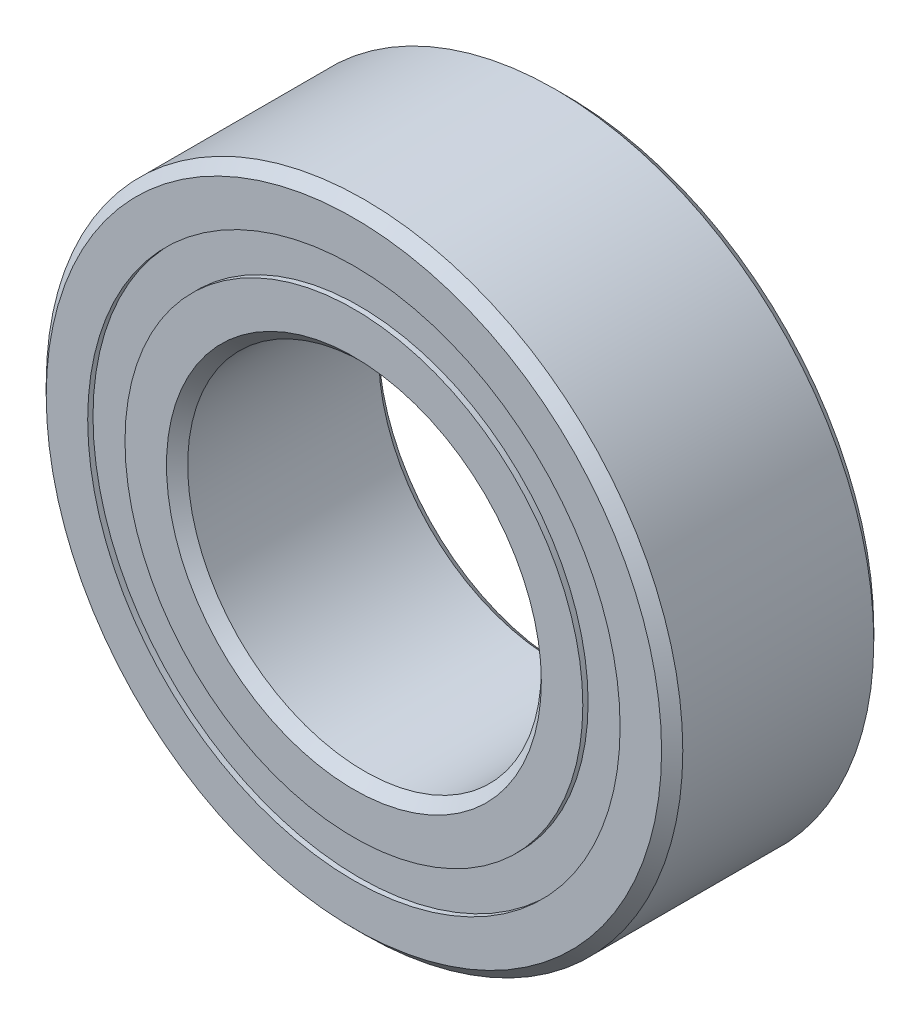
ISO-10303-21;
HEADER;
FILE_DESCRIPTION(('STEP AP214'),'2;1');
FILE_NAME('part.step','',(''),(''),'','','');
FILE_SCHEMA(('AUTOMOTIVE_DESIGN { 1 0 10303 214 1 1 1 1 }'));
ENDSEC;
DATA;
#1=APPLICATION_CONTEXT('core data for automotive mechanical design processes');
#2=APPLICATION_PROTOCOL_DEFINITION('international standard','automotive_design',2000,#1);
#3=PRODUCT_CONTEXT('',#1,'mechanical');
#4=PRODUCT('Part','Part','',(#3));
#5=PRODUCT_RELATED_PRODUCT_CATEGORY('part','',(#4));
#6=PRODUCT_DEFINITION_FORMATION('','',#4);
#7=PRODUCT_DEFINITION_CONTEXT('part definition',#1,'design');
#8=PRODUCT_DEFINITION('design','',#6,#7);
#9=PRODUCT_DEFINITION_SHAPE('','',#8);
#10=(LENGTH_UNIT() NAMED_UNIT(*) SI_UNIT(.MILLI.,.METRE.));
#11=(NAMED_UNIT(*) PLANE_ANGLE_UNIT() SI_UNIT($,.RADIAN.));
#12=(NAMED_UNIT(*) SI_UNIT($,.STERADIAN.) SOLID_ANGLE_UNIT());
#13=UNCERTAINTY_MEASURE_WITH_UNIT(LENGTH_MEASURE(1.E-05),#10,'distance_accuracy_value','');
#14=(GEOMETRIC_REPRESENTATION_CONTEXT(3) GLOBAL_UNCERTAINTY_ASSIGNED_CONTEXT((#13)) GLOBAL_UNIT_ASSIGNED_CONTEXT((#10,
#11,#12)) REPRESENTATION_CONTEXT('',''));
#15=CARTESIAN_POINT('',(0.,0.,0.));
#16=DIRECTION('',(0.,0.,1.));
#17=DIRECTION('',(1.,0.,0.));
#18=AXIS2_PLACEMENT_3D('',#15,#16,#17);
#19=CARTESIAN_POINT('',(0.,3.76373626373626,-1.425));
#20=DIRECTION('',(0.,0.,1.));
#21=DIRECTION('',(1.,0.,0.));
#22=AXIS2_PLACEMENT_3D('',#19,#20,#21);
#23=PLANE('',#22);
#24=CARTESIAN_POINT('',(0.,0.,-1.425));
#25=DIRECTION('',(0.,0.,1.));
#26=DIRECTION('',(1.,0.,0.));
#27=AXIS2_PLACEMENT_3D('',#24,#25,#26);
#28=CIRCLE('',#27,3.76373626373626);
#29=CARTESIAN_POINT('',(3.76373626373626,0.,-1.425));
#30=VERTEX_POINT('',#29);
#31=EDGE_CURVE('E55',#30,#30,#28,.T.);
#32=ORIENTED_EDGE('',*,*,#31,.F.);
#33=EDGE_LOOP('',(#32));
#34=FACE_BOUND('',#33,.T.);
#35=CARTESIAN_POINT('',(0.,0.,-1.425));
#36=DIRECTION('',(0.,0.,1.));
#37=DIRECTION('',(1.,0.,0.));
#38=AXIS2_PLACEMENT_3D('',#35,#36,#37);
#39=CIRCLE('',#38,3.23626373626374);
#40=CARTESIAN_POINT('',(3.23626373626374,0.,-1.425));
#41=VERTEX_POINT('',#40);
#42=EDGE_CURVE('E11',#41,#41,#39,.T.);
#43=ORIENTED_EDGE('',*,*,#42,.T.);
#44=EDGE_LOOP('',(#43));
#45=FACE_BOUND('',#44,.T.);
#46=ADVANCED_FACE('F41',(#34,#45),#23,.F.);
#47=CARTESIAN_POINT('',(0.,0.,1.5));
#48=DIRECTION('',(0.,0.,1.));
#49=DIRECTION('',(1.,0.,0.));
#50=AXIS2_PLACEMENT_3D('',#47,#48,#49);
#51=CYLINDRICAL_SURFACE('',#50,3.23626373626374);
#52=ORIENTED_EDGE('',*,*,#42,.F.);
#53=EDGE_LOOP('',(#52));
#54=FACE_BOUND('',#53,.T.);
#55=CARTESIAN_POINT('',(0.,0.,-0.716938812768572));
#56=DIRECTION('',(0.,0.,1.));
#57=DIRECTION('',(1.,0.,0.));
#58=AXIS2_PLACEMENT_3D('',#55,#56,#57);
#59=CIRCLE('',#58,3.23626373626374);
#60=CARTESIAN_POINT('',(3.23626373626374,0.,-0.716938812768572));
#61=VERTEX_POINT('',#60);
#62=EDGE_CURVE('E47',#61,#61,#59,.T.);
#63=ORIENTED_EDGE('',*,*,#62,.T.);
#64=EDGE_LOOP('',(#63));
#65=FACE_BOUND('',#64,.T.);
#66=ADVANCED_FACE('F64',(#54,#65),#51,.F.);
#67=CARTESIAN_POINT('',(0.,3.76373626373626,-0.716938812768571));
#68=DIRECTION('',(0.,0.,-1.));
#69=DIRECTION('',(-1.,0.,0.));
#70=AXIS2_PLACEMENT_3D('',#67,#68,#69);
#71=PLANE('',#70);
#72=ORIENTED_EDGE('',*,*,#62,.F.);
#73=EDGE_LOOP('',(#72));
#74=FACE_BOUND('',#73,.T.);
#75=CARTESIAN_POINT('',(0.,0.,-0.716938812768571));
#76=DIRECTION('',(0.,0.,1.));
#77=DIRECTION('',(1.,0.,0.));
#78=AXIS2_PLACEMENT_3D('',#75,#76,#77);
#79=CIRCLE('',#78,3.76373626373626);
#80=CARTESIAN_POINT('',(3.76373626373626,0.,-0.716938812768571));
#81=VERTEX_POINT('',#80);
#82=EDGE_CURVE('E51',#81,#81,#79,.T.);
#83=ORIENTED_EDGE('',*,*,#82,.T.);
#84=EDGE_LOOP('',(#83));
#85=FACE_BOUND('',#84,.T.);
#86=ADVANCED_FACE('F68',(#74,#85),#71,.F.);
#87=CARTESIAN_POINT('',(0.,0.,1.5));
#88=DIRECTION('',(0.,0.,1.));
#89=DIRECTION('',(1.,0.,0.));
#90=AXIS2_PLACEMENT_3D('',#87,#88,#89);
#91=CYLINDRICAL_SURFACE('',#90,3.76373626373626);
#92=ORIENTED_EDGE('',*,*,#82,.F.);
#93=EDGE_LOOP('',(#92));
#94=FACE_BOUND('',#93,.T.);
#95=ORIENTED_EDGE('',*,*,#31,.T.);
#96=EDGE_LOOP('',(#95));
#97=FACE_BOUND('',#96,.T.);
#98=ADVANCED_FACE('F61',(#94,#97),#91,.T.);
#99=CLOSED_SHELL('',(#46,#66,#86,#98));
#100=MANIFOLD_SOLID_BREP('B2',#99);
#101=CARTESIAN_POINT('',(0.,3.76373626373626,1.425));
#102=DIRECTION('',(0.,0.,-1.));
#103=DIRECTION('',(-1.,0.,0.));
#104=AXIS2_PLACEMENT_3D('',#101,#102,#103);
#105=PLANE('',#104);
#106=CARTESIAN_POINT('',(0.,0.,1.425));
#107=DIRECTION('',(0.,0.,1.));
#108=DIRECTION('',(1.,0.,0.));
#109=AXIS2_PLACEMENT_3D('',#106,#107,#108);
#110=CIRCLE('',#109,3.23626373626374);
#111=CARTESIAN_POINT('',(3.23626373626374,0.,1.425));
#112=VERTEX_POINT('',#111);
#113=EDGE_CURVE('E40',#112,#112,#110,.T.);
#114=ORIENTED_EDGE('',*,*,#113,.F.);
#115=EDGE_LOOP('',(#114));
#116=FACE_BOUND('',#115,.T.);
#117=CARTESIAN_POINT('',(0.,0.,1.425));
#118=DIRECTION('',(0.,0.,1.));
#119=DIRECTION('',(1.,0.,0.));
#120=AXIS2_PLACEMENT_3D('',#117,#118,#119);
#121=CIRCLE('',#120,3.76373626373626);
#122=CARTESIAN_POINT('',(3.76373626373626,0.,1.425));
#123=VERTEX_POINT('',#122);
#124=EDGE_CURVE('E122',#123,#123,#121,.T.);
#125=ORIENTED_EDGE('',*,*,#124,.T.);
#126=EDGE_LOOP('',(#125));
#127=FACE_BOUND('',#126,.T.);
#128=ADVANCED_FACE('F108',(#116,#127),#105,.F.);
#129=CARTESIAN_POINT('',(0.,0.,1.5));
#130=DIRECTION('',(0.,0.,1.));
#131=DIRECTION('',(1.,0.,0.));
#132=AXIS2_PLACEMENT_3D('',#129,#130,#131);
#133=CYLINDRICAL_SURFACE('',#132,3.23626373626374);
#134=CARTESIAN_POINT('',(0.,0.,0.716938812768571));
#135=DIRECTION('',(0.,0.,1.));
#136=DIRECTION('',(1.,0.,0.));
#137=AXIS2_PLACEMENT_3D('',#134,#135,#136);
#138=CIRCLE('',#137,3.23626373626374);
#139=CARTESIAN_POINT('',(3.23626373626374,0.,0.716938812768571));
#140=VERTEX_POINT('',#139);
#141=EDGE_CURVE('E114',#140,#140,#138,.T.);
#142=ORIENTED_EDGE('',*,*,#141,.F.);
#143=EDGE_LOOP('',(#142));
#144=FACE_BOUND('',#143,.T.);
#145=ORIENTED_EDGE('',*,*,#113,.T.);
#146=EDGE_LOOP('',(#145));
#147=FACE_BOUND('',#146,.T.);
#148=ADVANCED_FACE('F137',(#144,#147),#133,.F.);
#149=CARTESIAN_POINT('',(0.,3.76373626373626,0.716938812768571));
#150=DIRECTION('',(0.,0.,1.));
#151=DIRECTION('',(1.,0.,0.));
#152=AXIS2_PLACEMENT_3D('',#149,#150,#151);
#153=PLANE('',#152);
#154=CARTESIAN_POINT('',(0.,0.,0.716938812768571));
#155=DIRECTION('',(0.,0.,1.));
#156=DIRECTION('',(1.,0.,0.));
#157=AXIS2_PLACEMENT_3D('',#154,#155,#156);
#158=CIRCLE('',#157,3.76373626373626);
#159=CARTESIAN_POINT('',(3.76373626373626,0.,0.716938812768571));
#160=VERTEX_POINT('',#159);
#161=EDGE_CURVE('E118',#160,#160,#158,.T.);
#162=ORIENTED_EDGE('',*,*,#161,.F.);
#163=EDGE_LOOP('',(#162));
#164=FACE_BOUND('',#163,.T.);
#165=ORIENTED_EDGE('',*,*,#141,.T.);
#166=EDGE_LOOP('',(#165));
#167=FACE_BOUND('',#166,.T.);
#168=ADVANCED_FACE('F132',(#164,#167),#153,.F.);
#169=CARTESIAN_POINT('',(0.,0.,1.5));
#170=DIRECTION('',(0.,0.,1.));
#171=DIRECTION('',(1.,0.,0.));
#172=AXIS2_PLACEMENT_3D('',#169,#170,#171);
#173=CYLINDRICAL_SURFACE('',#172,3.76373626373626);
#174=ORIENTED_EDGE('',*,*,#124,.F.);
#175=EDGE_LOOP('',(#174));
#176=FACE_BOUND('',#175,.T.);
#177=ORIENTED_EDGE('',*,*,#161,.T.);
#178=EDGE_LOOP('',(#177));
#179=FACE_BOUND('',#178,.T.);
#180=ADVANCED_FACE('F129',(#176,#179),#173,.T.);
#181=CLOSED_SHELL('',(#128,#148,#168,#180));
#182=MANIFOLD_SOLID_BREP('B6',#181);
#183=CARTESIAN_POINT('',(-1.74999999999996,3.03108891324556,0.));
#184=DIRECTION('',(0.,0.,1.));
#185=DIRECTION('',(-0.499999999999989,0.866025403784445,0.));
#186=AXIS2_PLACEMENT_3D('',#183,#184,#185);
#187=SPHERICAL_SURFACE('',#186,0.716938812768571);
#188=CARTESIAN_POINT('',(-1.74999999999996,3.03108891324556,0.716938812768571));
#189=VERTEX_POINT('',#188);
#190=VERTEX_LOOP('',#189);
#191=FACE_BOUND('',#190,.T.);
#192=ADVANCED_FACE('F175',(#191),#187,.T.);
#193=CLOSED_SHELL('',(#192));
#194=MANIFOLD_SOLID_BREP('B35',#193);
#195=CARTESIAN_POINT('',(-3.03108891324551,1.75000000000004,0.));
#196=DIRECTION('',(0.,0.,1.));
#197=DIRECTION('',(-0.866025403784433,0.50000000000001,0.));
#198=AXIS2_PLACEMENT_3D('',#195,#196,#197);
#199=SPHERICAL_SURFACE('',#198,0.716938812768571);
#200=CARTESIAN_POINT('',(-3.03108891324551,1.75000000000004,0.716938812768571));
#201=VERTEX_POINT('',#200);
#202=VERTEX_LOOP('',#201);
#203=FACE_BOUND('',#202,.T.);
#204=ADVANCED_FACE('F195',(#203),#199,.T.);
#205=CLOSED_SHELL('',(#204));
#206=MANIFOLD_SOLID_BREP('B104',#205);
#207=CARTESIAN_POINT('',(-3.5,0.,0.));
#208=DIRECTION('',(0.,0.,1.));
#209=DIRECTION('',(-1.,0.,0.));
#210=AXIS2_PLACEMENT_3D('',#207,#208,#209);
#211=SPHERICAL_SURFACE('',#210,0.716938812768571);
#212=CARTESIAN_POINT('',(-3.5,0.,0.716938812768571));
#213=VERTEX_POINT('',#212);
#214=VERTEX_LOOP('',#213);
#215=FACE_BOUND('',#214,.T.);
#216=ADVANCED_FACE('F215',(#215),#211,.T.);
#217=CLOSED_SHELL('',(#216));
#218=MANIFOLD_SOLID_BREP('B171',#217);
#219=CARTESIAN_POINT('',(-3.03108891324555,-1.74999999999997,0.));
#220=DIRECTION('',(0.,0.,1.));
#221=DIRECTION('',(-0.866025403784443,-0.499999999999992,0.));
#222=AXIS2_PLACEMENT_3D('',#219,#220,#221);
#223=SPHERICAL_SURFACE('',#222,0.716938812768571);
#224=CARTESIAN_POINT('',(-3.03108891324555,-1.74999999999997,0.716938812768571));
#225=VERTEX_POINT('',#224);
#226=VERTEX_LOOP('',#225);
#227=FACE_BOUND('',#226,.T.);
#228=ADVANCED_FACE('F235',(#227),#223,.T.);
#229=CLOSED_SHELL('',(#228));
#230=MANIFOLD_SOLID_BREP('B191',#229);
#231=CARTESIAN_POINT('',(-1.75000000000002,-3.03108891324552,0.));
#232=DIRECTION('',(0.,0.,1.));
#233=DIRECTION('',(-0.500000000000007,-0.866025403784435,0.));
#234=AXIS2_PLACEMENT_3D('',#231,#232,#233);
#235=SPHERICAL_SURFACE('',#234,0.716938812768571);
#236=CARTESIAN_POINT('',(-1.75000000000002,-3.03108891324552,0.716938812768571));
#237=VERTEX_POINT('',#236);
#238=VERTEX_LOOP('',#237);
#239=FACE_BOUND('',#238,.T.);
#240=ADVANCED_FACE('F255',(#239),#235,.T.);
#241=CLOSED_SHELL('',(#240));
#242=MANIFOLD_SOLID_BREP('B211',#241);
#243=CARTESIAN_POINT('',(0.,-3.5,0.));
#244=DIRECTION('',(0.,0.,1.));
#245=DIRECTION('',(0.,-1.,0.));
#246=AXIS2_PLACEMENT_3D('',#243,#244,#245);
#247=SPHERICAL_SURFACE('',#246,0.716938812768571);
#248=CARTESIAN_POINT('',(0.,-3.5,0.716938812768571));
#249=VERTEX_POINT('',#248);
#250=VERTEX_LOOP('',#249);
#251=FACE_BOUND('',#250,.T.);
#252=ADVANCED_FACE('F275',(#251),#247,.T.);
#253=CLOSED_SHELL('',(#252));
#254=MANIFOLD_SOLID_BREP('B231',#253);
#255=CARTESIAN_POINT('',(1.74999999999998,-3.03108891324554,0.));
#256=DIRECTION('',(0.,0.,1.));
#257=DIRECTION('',(0.499999999999995,-0.866025403784442,0.));
#258=AXIS2_PLACEMENT_3D('',#255,#256,#257);
#259=SPHERICAL_SURFACE('',#258,0.716938812768571);
#260=CARTESIAN_POINT('',(1.74999999999998,-3.03108891324554,0.716938812768571));
#261=VERTEX_POINT('',#260);
#262=VERTEX_LOOP('',#261);
#263=FACE_BOUND('',#262,.T.);
#264=ADVANCED_FACE('F295',(#263),#259,.T.);
#265=CLOSED_SHELL('',(#264));
#266=MANIFOLD_SOLID_BREP('B251',#265);
#267=CARTESIAN_POINT('',(3.03108891324553,-1.75000000000001,0.));
#268=DIRECTION('',(0.,0.,1.));
#269=DIRECTION('',(0.866025403784436,-0.500000000000004,0.));
#270=AXIS2_PLACEMENT_3D('',#267,#268,#269);
#271=SPHERICAL_SURFACE('',#270,0.716938812768571);
#272=CARTESIAN_POINT('',(3.03108891324553,-1.75000000000001,0.716938812768571));
#273=VERTEX_POINT('',#272);
#274=VERTEX_LOOP('',#273);
#275=FACE_BOUND('',#274,.T.);
#276=ADVANCED_FACE('F315',(#275),#271,.T.);
#277=CLOSED_SHELL('',(#276));
#278=MANIFOLD_SOLID_BREP('B271',#277);
#279=CARTESIAN_POINT('',(3.5,0.,0.));
#280=DIRECTION('',(0.,0.,1.));
#281=DIRECTION('',(1.,0.,0.));
#282=AXIS2_PLACEMENT_3D('',#279,#280,#281);
#283=SPHERICAL_SURFACE('',#282,0.716938812768571);
#284=CARTESIAN_POINT('',(3.5,0.,0.716938812768571));
#285=VERTEX_POINT('',#284);
#286=VERTEX_LOOP('',#285);
#287=FACE_BOUND('',#286,.T.);
#288=ADVANCED_FACE('F335',(#287),#283,.T.);
#289=CLOSED_SHELL('',(#288));
#290=MANIFOLD_SOLID_BREP('B291',#289);
#291=CARTESIAN_POINT('',(3.03108891324554,1.74999999999999,0.));
#292=DIRECTION('',(0.,0.,1.));
#293=DIRECTION('',(0.86602540378444,0.499999999999998,0.));
#294=AXIS2_PLACEMENT_3D('',#291,#292,#293);
#295=SPHERICAL_SURFACE('',#294,0.716938812768571);
#296=CARTESIAN_POINT('',(3.03108891324554,1.74999999999999,0.716938812768571));
#297=VERTEX_POINT('',#296);
#298=VERTEX_LOOP('',#297);
#299=FACE_BOUND('',#298,.T.);
#300=ADVANCED_FACE('F355',(#299),#295,.T.);
#301=CLOSED_SHELL('',(#300));
#302=MANIFOLD_SOLID_BREP('B311',#301);
#303=CARTESIAN_POINT('',(1.75,3.03108891324553,0.));
#304=DIRECTION('',(0.,0.,1.));
#305=DIRECTION('',(0.500000000000001,0.866025403784438,0.));
#306=AXIS2_PLACEMENT_3D('',#303,#304,#305);
#307=SPHERICAL_SURFACE('',#306,0.716938812768571);
#308=CARTESIAN_POINT('',(1.75,3.03108891324553,0.716938812768571));
#309=VERTEX_POINT('',#308);
#310=VERTEX_LOOP('',#309);
#311=FACE_BOUND('',#310,.T.);
#312=ADVANCED_FACE('F375',(#311),#307,.T.);
#313=CLOSED_SHELL('',(#312));
#314=MANIFOLD_SOLID_BREP('B331',#313);
#315=CARTESIAN_POINT('',(0.,3.5,0.));
#316=DIRECTION('',(0.,0.,1.));
#317=DIRECTION('',(0.,1.,0.));
#318=AXIS2_PLACEMENT_3D('',#315,#316,#317);
#319=SPHERICAL_SURFACE('',#318,0.716938812768571);
#320=CARTESIAN_POINT('',(0.,3.5,0.716938812768571));
#321=VERTEX_POINT('',#320);
#322=VERTEX_LOOP('',#321);
#323=FACE_BOUND('',#322,.T.);
#324=ADVANCED_FACE('F397',(#323),#319,.T.);
#325=CLOSED_SHELL('',(#324));
#326=MANIFOLD_SOLID_BREP('B351',#325);
#327=CARTESIAN_POINT('',(0.,3.23626373626374,1.5));
#328=DIRECTION('',(0.,0.,-1.));
#329=DIRECTION('',(-1.,0.,0.));
#330=AXIS2_PLACEMENT_3D('',#327,#328,#329);
#331=PLANE('',#330);
#332=CARTESIAN_POINT('',(0.,0.,1.5));
#333=DIRECTION('',(0.,0.,1.));
#334=DIRECTION('',(1.,0.,0.));
#335=AXIS2_PLACEMENT_3D('',#332,#333,#334);
#336=CIRCLE('',#335,2.65);
#337=CARTESIAN_POINT('',(2.65,0.,1.5));
#338=VERTEX_POINT('',#337);
#339=EDGE_CURVE('E444',#338,#338,#336,.T.);
#340=ORIENTED_EDGE('',*,*,#339,.F.);
#341=EDGE_LOOP('',(#340));
#342=FACE_BOUND('',#341,.T.);
#343=CARTESIAN_POINT('',(0.,0.,1.5));
#344=DIRECTION('',(0.,0.,1.));
#345=DIRECTION('',(1.,0.,0.));
#346=AXIS2_PLACEMENT_3D('',#343,#344,#345);
#347=CIRCLE('',#346,3.23626373626374);
#348=CARTESIAN_POINT('',(3.23626373626374,0.,1.5));
#349=VERTEX_POINT('',#348);
#350=EDGE_CURVE('E396',#349,#349,#347,.T.);
#351=ORIENTED_EDGE('',*,*,#350,.T.);
#352=EDGE_LOOP('',(#351));
#353=FACE_BOUND('',#352,.T.);
#354=ADVANCED_FACE('F416',(#342,#353),#331,.F.);
#355=CARTESIAN_POINT('',(0.,0.,1.5));
#356=DIRECTION('',(0.,0.,1.));
#357=DIRECTION('',(1.,0.,0.));
#358=AXIS2_PLACEMENT_3D('',#355,#356,#357);
#359=CYLINDRICAL_SURFACE('',#358,3.23626373626374);
#360=ORIENTED_EDGE('',*,*,#350,.F.);
#361=EDGE_LOOP('',(#360));
#362=FACE_BOUND('',#361,.T.);
#363=CARTESIAN_POINT('',(0.,0.,0.666666666666667));
#364=DIRECTION('',(0.,0.,1.));
#365=DIRECTION('',(1.,0.,0.));
#366=AXIS2_PLACEMENT_3D('',#363,#364,#365);
#367=CIRCLE('',#366,3.23626373626374);
#368=CARTESIAN_POINT('',(3.23626373626374,0.,0.666666666666667));
#369=VERTEX_POINT('',#368);
#370=EDGE_CURVE('E422',#369,#369,#367,.T.);
#371=ORIENTED_EDGE('',*,*,#370,.T.);
#372=EDGE_LOOP('',(#371));
#373=FACE_BOUND('',#372,.T.);
#374=ADVANCED_FACE('F451',(#362,#373),#359,.T.);
#375=CARTESIAN_POINT('',(0.,0.,0.));
#376=DIRECTION('',(0.,0.,1.));
#377=DIRECTION('',(1.,0.,0.));
#378=AXIS2_PLACEMENT_3D('',#375,#376,#377);
#379=TOROIDAL_SURFACE('',#378,3.5,0.71693881276857);
#380=ORIENTED_EDGE('',*,*,#370,.F.);
#381=EDGE_LOOP('',(#380));
#382=FACE_BOUND('',#381,.T.);
#383=CARTESIAN_POINT('',(0.,0.,-0.666666666666667));
#384=DIRECTION('',(0.,0.,1.));
#385=DIRECTION('',(1.,0.,0.));
#386=AXIS2_PLACEMENT_3D('',#383,#384,#385);
#387=CIRCLE('',#386,3.23626373626374);
#388=CARTESIAN_POINT('',(3.23626373626374,0.,-0.666666666666667));
#389=VERTEX_POINT('',#388);
#390=EDGE_CURVE('E426',#389,#389,#387,.T.);
#391=ORIENTED_EDGE('',*,*,#390,.T.);
#392=EDGE_LOOP('',(#391));
#393=FACE_BOUND('',#392,.T.);
#394=ADVANCED_FACE('F455',(#382,#393),#379,.F.);
#395=CARTESIAN_POINT('',(0.,0.,1.5));
#396=DIRECTION('',(0.,0.,1.));
#397=DIRECTION('',(1.,0.,0.));
#398=AXIS2_PLACEMENT_3D('',#395,#396,#397);
#399=CYLINDRICAL_SURFACE('',#398,3.23626373626374);
#400=ORIENTED_EDGE('',*,*,#390,.F.);
#401=EDGE_LOOP('',(#400));
#402=FACE_BOUND('',#401,.T.);
#403=CARTESIAN_POINT('',(0.,0.,-1.5));
#404=DIRECTION('',(0.,0.,1.));
#405=DIRECTION('',(1.,0.,0.));
#406=AXIS2_PLACEMENT_3D('',#403,#404,#405);
#407=CIRCLE('',#406,3.23626373626374);
#408=CARTESIAN_POINT('',(3.23626373626374,0.,-1.5));
#409=VERTEX_POINT('',#408);
#410=EDGE_CURVE('E430',#409,#409,#407,.T.);
#411=ORIENTED_EDGE('',*,*,#410,.T.);
#412=EDGE_LOOP('',(#411));
#413=FACE_BOUND('',#412,.T.);
#414=ADVANCED_FACE('F460',(#402,#413),#399,.T.);
#415=CARTESIAN_POINT('',(0.,2.65,-1.5));
#416=DIRECTION('',(0.,0.,1.));
#417=DIRECTION('',(1.,0.,0.));
#418=AXIS2_PLACEMENT_3D('',#415,#416,#417);
#419=PLANE('',#418);
#420=ORIENTED_EDGE('',*,*,#410,.F.);
#421=EDGE_LOOP('',(#420));
#422=FACE_BOUND('',#421,.T.);
#423=CARTESIAN_POINT('',(0.,0.,-1.5));
#424=DIRECTION('',(0.,0.,1.));
#425=DIRECTION('',(1.,0.,0.));
#426=AXIS2_PLACEMENT_3D('',#423,#424,#425);
#427=CIRCLE('',#426,2.65);
#428=CARTESIAN_POINT('',(2.65,0.,-1.5));
#429=VERTEX_POINT('',#428);
#430=EDGE_CURVE('E435',#429,#429,#427,.T.);
#431=ORIENTED_EDGE('',*,*,#430,.T.);
#432=EDGE_LOOP('',(#431));
#433=FACE_BOUND('',#432,.T.);
#434=ADVANCED_FACE('F466',(#422,#433),#419,.F.);
#435=CARTESIAN_POINT('',(0.,0.,-1.35));
#436=DIRECTION('',(0.,0.,-1.));
#437=DIRECTION('',(-1.,0.,0.));
#438=AXIS2_PLACEMENT_3D('',#435,#436,#437);
#439=CONICAL_SURFACE('',#438,2.5,0.785398163397445);
#440=ORIENTED_EDGE('',*,*,#430,.F.);
#441=EDGE_LOOP('',(#440));
#442=FACE_BOUND('',#441,.T.);
#443=CARTESIAN_POINT('',(0.,0.,-1.35));
#444=DIRECTION('',(0.,0.,1.));
#445=DIRECTION('',(1.,0.,0.));
#446=AXIS2_PLACEMENT_3D('',#443,#444,#445);
#447=CIRCLE('',#446,2.5);
#448=CARTESIAN_POINT('',(2.5,0.,-1.35));
#449=VERTEX_POINT('',#448);
#450=EDGE_CURVE('E438',#449,#449,#447,.T.);
#451=ORIENTED_EDGE('',*,*,#450,.T.);
#452=EDGE_LOOP('',(#451));
#453=FACE_BOUND('',#452,.T.);
#454=ADVANCED_FACE('F470',(#442,#453),#439,.F.);
#455=CARTESIAN_POINT('',(0.,0.,1.5));
#456=DIRECTION('',(0.,0.,1.));
#457=DIRECTION('',(1.,0.,0.));
#458=AXIS2_PLACEMENT_3D('',#455,#456,#457);
#459=CYLINDRICAL_SURFACE('',#458,2.5);
#460=ORIENTED_EDGE('',*,*,#450,.F.);
#461=EDGE_LOOP('',(#460));
#462=FACE_BOUND('',#461,.T.);
#463=CARTESIAN_POINT('',(0.,0.,1.35));
#464=DIRECTION('',(0.,0.,1.));
#465=DIRECTION('',(1.,0.,0.));
#466=AXIS2_PLACEMENT_3D('',#463,#464,#465);
#467=CIRCLE('',#466,2.5);
#468=CARTESIAN_POINT('',(2.5,0.,1.35));
#469=VERTEX_POINT('',#468);
#470=EDGE_CURVE('E441',#469,#469,#467,.T.);
#471=ORIENTED_EDGE('',*,*,#470,.T.);
#472=EDGE_LOOP('',(#471));
#473=FACE_BOUND('',#472,.T.);
#474=ADVANCED_FACE('F474',(#462,#473),#459,.F.);
#475=CARTESIAN_POINT('',(0.,0.,1.5));
#476=DIRECTION('',(0.,0.,1.));
#477=DIRECTION('',(1.,0.,0.));
#478=AXIS2_PLACEMENT_3D('',#475,#476,#477);
#479=CONICAL_SURFACE('',#478,2.65,0.785398163397451);
#480=ORIENTED_EDGE('',*,*,#470,.F.);
#481=EDGE_LOOP('',(#480));
#482=FACE_BOUND('',#481,.T.);
#483=ORIENTED_EDGE('',*,*,#339,.T.);
#484=EDGE_LOOP('',(#483));
#485=FACE_BOUND('',#484,.T.);
#486=ADVANCED_FACE('F448',(#482,#485),#479,.F.);
#487=CLOSED_SHELL('',(#354,#374,#394,#414,#434,#454,#474,#486));
#488=MANIFOLD_SOLID_BREP('B371',#487);
#489=CARTESIAN_POINT('',(0.,0.,1.35));
#490=DIRECTION('',(0.,0.,-1.));
#491=DIRECTION('',(-1.,0.,0.));
#492=AXIS2_PLACEMENT_3D('',#489,#490,#491);
#493=CONICAL_SURFACE('',#492,4.5,0.785398163397445);
#494=CARTESIAN_POINT('',(0.,0.,1.5));
#495=DIRECTION('',(0.,0.,1.));
#496=DIRECTION('',(1.,0.,0.));
#497=AXIS2_PLACEMENT_3D('',#494,#495,#496);
#498=CIRCLE('',#497,4.35);
#499=CARTESIAN_POINT('',(4.35,0.,1.5));
#500=VERTEX_POINT('',#499);
#501=EDGE_CURVE('E565',#500,#500,#498,.T.);
#502=ORIENTED_EDGE('',*,*,#501,.F.);
#503=EDGE_LOOP('',(#502));
#504=FACE_BOUND('',#503,.T.);
#505=CARTESIAN_POINT('',(0.,0.,1.35));
#506=DIRECTION('',(0.,0.,1.));
#507=DIRECTION('',(1.,0.,0.));
#508=AXIS2_PLACEMENT_3D('',#505,#506,#507);
#509=CIRCLE('',#508,4.5);
#510=CARTESIAN_POINT('',(4.5,0.,1.35));
#511=VERTEX_POINT('',#510);
#512=EDGE_CURVE('E415',#511,#511,#509,.T.);
#513=ORIENTED_EDGE('',*,*,#512,.T.);
#514=EDGE_LOOP('',(#513));
#515=FACE_BOUND('',#514,.T.);
#516=ADVANCED_FACE('F537',(#504,#515),#493,.T.);
#517=CARTESIAN_POINT('',(0.,0.,1.5));
#518=DIRECTION('',(0.,0.,1.));
#519=DIRECTION('',(1.,0.,0.));
#520=AXIS2_PLACEMENT_3D('',#517,#518,#519);
#521=CYLINDRICAL_SURFACE('',#520,4.5);
#522=ORIENTED_EDGE('',*,*,#512,.F.);
#523=EDGE_LOOP('',(#522));
#524=FACE_BOUND('',#523,.T.);
#525=CARTESIAN_POINT('',(0.,0.,-1.35));
#526=DIRECTION('',(0.,0.,1.));
#527=DIRECTION('',(1.,0.,0.));
#528=AXIS2_PLACEMENT_3D('',#525,#526,#527);
#529=CIRCLE('',#528,4.5);
#530=CARTESIAN_POINT('',(4.5,0.,-1.35));
#531=VERTEX_POINT('',#530);
#532=EDGE_CURVE('E543',#531,#531,#529,.T.);
#533=ORIENTED_EDGE('',*,*,#532,.T.);
#534=EDGE_LOOP('',(#533));
#535=FACE_BOUND('',#534,.T.);
#536=ADVANCED_FACE('F572',(#524,#535),#521,.T.);
#537=CARTESIAN_POINT('',(0.,0.,-1.5));
#538=DIRECTION('',(0.,0.,1.));
#539=DIRECTION('',(1.,0.,0.));
#540=AXIS2_PLACEMENT_3D('',#537,#538,#539);
#541=CONICAL_SURFACE('',#540,4.35,0.785398163397445);
#542=ORIENTED_EDGE('',*,*,#532,.F.);
#543=EDGE_LOOP('',(#542));
#544=FACE_BOUND('',#543,.T.);
#545=CARTESIAN_POINT('',(0.,0.,-1.5));
#546=DIRECTION('',(0.,0.,1.));
#547=DIRECTION('',(1.,0.,0.));
#548=AXIS2_PLACEMENT_3D('',#545,#546,#547);
#549=CIRCLE('',#548,4.35);
#550=CARTESIAN_POINT('',(4.35,0.,-1.5));
#551=VERTEX_POINT('',#550);
#552=EDGE_CURVE('E547',#551,#551,#549,.T.);
#553=ORIENTED_EDGE('',*,*,#552,.T.);
#554=EDGE_LOOP('',(#553));
#555=FACE_BOUND('',#554,.T.);
#556=ADVANCED_FACE('F576',(#544,#555),#541,.T.);
#557=CARTESIAN_POINT('',(0.,4.35,-1.5));
#558=DIRECTION('',(0.,0.,1.));
#559=DIRECTION('',(1.,0.,0.));
#560=AXIS2_PLACEMENT_3D('',#557,#558,#559);
#561=PLANE('',#560);
#562=ORIENTED_EDGE('',*,*,#552,.F.);
#563=EDGE_LOOP('',(#562));
#564=FACE_BOUND('',#563,.T.);
#565=CARTESIAN_POINT('',(0.,0.,-1.5));
#566=DIRECTION('',(0.,0.,1.));
#567=DIRECTION('',(1.,0.,0.));
#568=AXIS2_PLACEMENT_3D('',#565,#566,#567);
#569=CIRCLE('',#568,3.76373626373626);
#570=CARTESIAN_POINT('',(3.76373626373626,0.,-1.5));
#571=VERTEX_POINT('',#570);
#572=EDGE_CURVE('E551',#571,#571,#569,.T.);
#573=ORIENTED_EDGE('',*,*,#572,.T.);
#574=EDGE_LOOP('',(#573));
#575=FACE_BOUND('',#574,.T.);
#576=ADVANCED_FACE('F581',(#564,#575),#561,.F.);
#577=CARTESIAN_POINT('',(0.,0.,1.5));
#578=DIRECTION('',(0.,0.,1.));
#579=DIRECTION('',(1.,0.,0.));
#580=AXIS2_PLACEMENT_3D('',#577,#578,#579);
#581=CYLINDRICAL_SURFACE('',#580,3.76373626373626);
#582=ORIENTED_EDGE('',*,*,#572,.F.);
#583=EDGE_LOOP('',(#582));
#584=FACE_BOUND('',#583,.T.);
#585=CARTESIAN_POINT('',(0.,0.,-0.666666666666667));
#586=DIRECTION('',(0.,0.,1.));
#587=DIRECTION('',(1.,0.,0.));
#588=AXIS2_PLACEMENT_3D('',#585,#586,#587);
#589=CIRCLE('',#588,3.76373626373626);
#590=CARTESIAN_POINT('',(3.76373626373626,0.,-0.666666666666667));
#591=VERTEX_POINT('',#590);
#592=EDGE_CURVE('E556',#591,#591,#589,.T.);
#593=ORIENTED_EDGE('',*,*,#592,.T.);
#594=EDGE_LOOP('',(#593));
#595=FACE_BOUND('',#594,.T.);
#596=ADVANCED_FACE('F587',(#584,#595),#581,.F.);
#597=CARTESIAN_POINT('',(0.,0.,0.));
#598=DIRECTION('',(0.,0.,1.));
#599=DIRECTION('',(1.,0.,0.));
#600=AXIS2_PLACEMENT_3D('',#597,#598,#599);
#601=TOROIDAL_SURFACE('',#600,3.5,0.716938812768571);
#602=ORIENTED_EDGE('',*,*,#592,.F.);
#603=EDGE_LOOP('',(#602));
#604=FACE_BOUND('',#603,.T.);
#605=CARTESIAN_POINT('',(0.,0.,0.666666666666667));
#606=DIRECTION('',(0.,0.,1.));
#607=DIRECTION('',(1.,0.,0.));
#608=AXIS2_PLACEMENT_3D('',#605,#606,#607);
#609=CIRCLE('',#608,3.76373626373626);
#610=CARTESIAN_POINT('',(3.76373626373626,0.,0.666666666666667));
#611=VERTEX_POINT('',#610);
#612=EDGE_CURVE('E559',#611,#611,#609,.T.);
#613=ORIENTED_EDGE('',*,*,#612,.T.);
#614=EDGE_LOOP('',(#613));
#615=FACE_BOUND('',#614,.T.);
#616=ADVANCED_FACE('F591',(#604,#615),#601,.F.);
#617=CARTESIAN_POINT('',(0.,0.,1.5));
#618=DIRECTION('',(0.,0.,1.));
#619=DIRECTION('',(1.,0.,0.));
#620=AXIS2_PLACEMENT_3D('',#617,#618,#619);
#621=CYLINDRICAL_SURFACE('',#620,3.76373626373626);
#622=ORIENTED_EDGE('',*,*,#612,.F.);
#623=EDGE_LOOP('',(#622));
#624=FACE_BOUND('',#623,.T.);
#625=CARTESIAN_POINT('',(0.,0.,1.5));
#626=DIRECTION('',(0.,0.,1.));
#627=DIRECTION('',(1.,0.,0.));
#628=AXIS2_PLACEMENT_3D('',#625,#626,#627);
#629=CIRCLE('',#628,3.76373626373626);
#630=CARTESIAN_POINT('',(3.76373626373626,0.,1.5));
#631=VERTEX_POINT('',#630);
#632=EDGE_CURVE('E562',#631,#631,#629,.T.);
#633=ORIENTED_EDGE('',*,*,#632,.T.);
#634=EDGE_LOOP('',(#633));
#635=FACE_BOUND('',#634,.T.);
#636=ADVANCED_FACE('F595',(#624,#635),#621,.F.);
#637=CARTESIAN_POINT('',(0.,4.35,1.5));
#638=DIRECTION('',(0.,0.,-1.));
#639=DIRECTION('',(-1.,0.,0.));
#640=AXIS2_PLACEMENT_3D('',#637,#638,#639);
#641=PLANE('',#640);
#642=ORIENTED_EDGE('',*,*,#632,.F.);
#643=EDGE_LOOP('',(#642));
#644=FACE_BOUND('',#643,.T.);
#645=ORIENTED_EDGE('',*,*,#501,.T.);
#646=EDGE_LOOP('',(#645));
#647=FACE_BOUND('',#646,.T.);
#648=ADVANCED_FACE('F569',(#644,#647),#641,.F.);
#649=CLOSED_SHELL('',(#516,#536,#556,#576,#596,#616,#636,#648));
#650=MANIFOLD_SOLID_BREP('B391',#649);
#651=ADVANCED_BREP_SHAPE_REPRESENTATION('',(#18,#100,#182,#194,#206,#218,#230,#242,#254,#266,
#278,#290,#302,#314,#326,#488,#650),#14);
#652=SHAPE_DEFINITION_REPRESENTATION(#9,#651);
ENDSEC;
END-ISO-10303-21;
